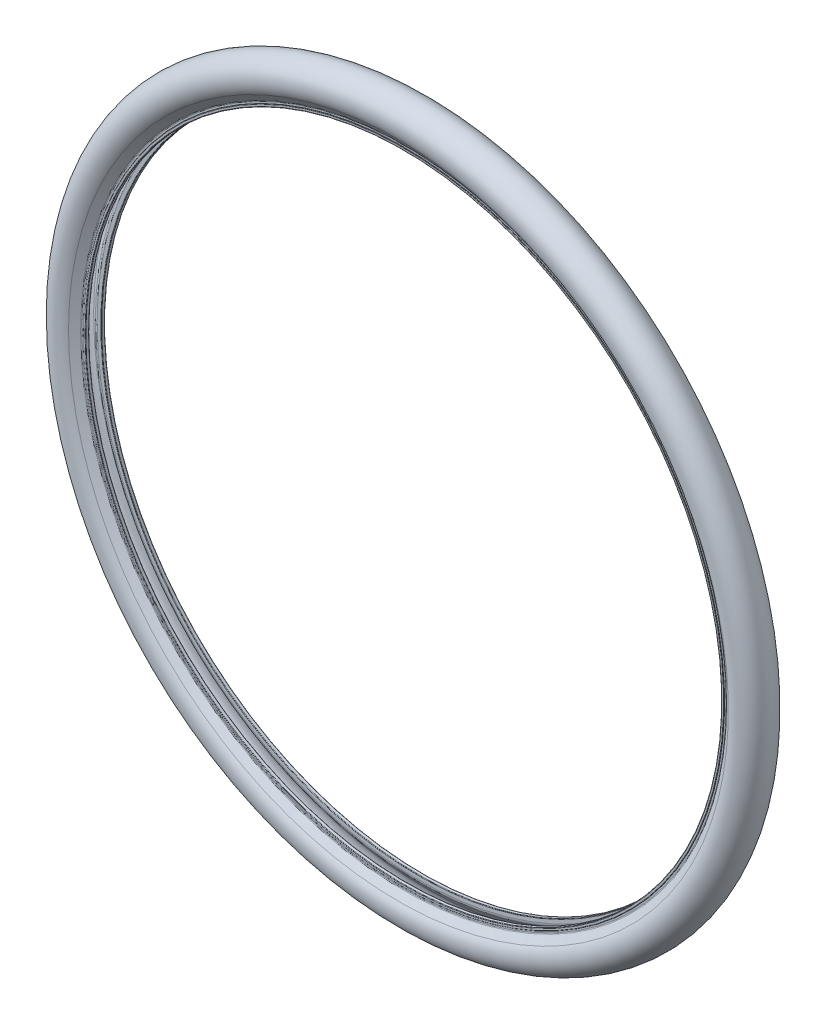
ISO-10303-21;
HEADER;
FILE_DESCRIPTION(('STEP AP214'),'2;1');
FILE_NAME('part.step','',(''),(''),'','','');
FILE_SCHEMA(('AUTOMOTIVE_DESIGN { 1 0 10303 214 1 1 1 1 }'));
ENDSEC;
DATA;
#1=APPLICATION_CONTEXT('core data for automotive mechanical design processes');
#2=APPLICATION_PROTOCOL_DEFINITION('international standard','automotive_design',2000,#1);
#3=PRODUCT_CONTEXT('',#1,'mechanical');
#4=PRODUCT('Part','Part','',(#3));
#5=PRODUCT_RELATED_PRODUCT_CATEGORY('part','',(#4));
#6=PRODUCT_DEFINITION_FORMATION('','',#4);
#7=PRODUCT_DEFINITION_CONTEXT('part definition',#1,'design');
#8=PRODUCT_DEFINITION('design','',#6,#7);
#9=PRODUCT_DEFINITION_SHAPE('','',#8);
#10=(LENGTH_UNIT() NAMED_UNIT(*) SI_UNIT(.MILLI.,.METRE.));
#11=(NAMED_UNIT(*) PLANE_ANGLE_UNIT() SI_UNIT($,.RADIAN.));
#12=(NAMED_UNIT(*) SI_UNIT($,.STERADIAN.) SOLID_ANGLE_UNIT());
#13=UNCERTAINTY_MEASURE_WITH_UNIT(LENGTH_MEASURE(1.E-05),#10,'distance_accuracy_value','');
#14=(GEOMETRIC_REPRESENTATION_CONTEXT(3) GLOBAL_UNCERTAINTY_ASSIGNED_CONTEXT((#13)) GLOBAL_UNIT_ASSIGNED_CONTEXT((#10,
#11,#12)) REPRESENTATION_CONTEXT('',''));
#15=CARTESIAN_POINT('',(0.,0.,0.));
#16=DIRECTION('',(0.,0.,1.));
#17=DIRECTION('',(1.,0.,0.));
#18=AXIS2_PLACEMENT_3D('',#15,#16,#17);
#19=CARTESIAN_POINT('',(0.,0.,-66.4924890033597));
#20=DIRECTION('',(0.,0.,-1.));
#21=DIRECTION('',(-1.,0.,0.));
#22=AXIS2_PLACEMENT_3D('',#19,#20,#21);
#23=CYLINDRICAL_SURFACE('',#22,312.);
#24=CARTESIAN_POINT('',(0.,0.,6.50000000000001));
#25=DIRECTION('',(0.,0.,-1.));
#26=DIRECTION('',(-1.,0.,0.));
#27=AXIS2_PLACEMENT_3D('',#24,#25,#26);
#28=CIRCLE('',#27,312.);
#29=CARTESIAN_POINT('',(-312.,0.,6.50000000000001));
#30=VERTEX_POINT('',#29);
#31=EDGE_CURVE('E10',#30,#30,#28,.T.);
#32=ORIENTED_EDGE('',*,*,#31,.T.);
#33=EDGE_LOOP('',(#32));
#34=FACE_BOUND('',#33,.T.);
#35=CARTESIAN_POINT('',(0.,0.,9.00000000000001));
#36=DIRECTION('',(0.,0.,-1.));
#37=DIRECTION('',(-1.,0.,0.));
#38=AXIS2_PLACEMENT_3D('',#35,#36,#37);
#39=CIRCLE('',#38,312.);
#40=CARTESIAN_POINT('',(-312.,0.,9.00000000000001));
#41=VERTEX_POINT('',#40);
#42=EDGE_CURVE('E65',#41,#41,#39,.F.);
#43=ORIENTED_EDGE('',*,*,#42,.T.);
#44=EDGE_LOOP('',(#43));
#45=FACE_BOUND('',#44,.T.);
#46=ADVANCED_FACE('F24',(#34,#45),#23,.F.);
#47=CARTESIAN_POINT('',(0.,0.,10.5));
#48=DIRECTION('',(0.,0.,-1.));
#49=DIRECTION('',(-1.,0.,0.));
#50=AXIS2_PLACEMENT_3D('',#47,#48,#49);
#51=TOROIDAL_SURFACE('',#50,316.,1.49999999999997);
#52=CARTESIAN_POINT('',(0.,0.,9.30000000000003));
#53=DIRECTION('',(0.,0.,-1.));
#54=DIRECTION('',(-1.,0.,0.));
#55=AXIS2_PLACEMENT_3D('',#52,#53,#54);
#56=CIRCLE('',#55,316.9);
#57=CARTESIAN_POINT('',(-316.9,0.,9.30000000000003));
#58=VERTEX_POINT('',#57);
#59=EDGE_CURVE('E68',#58,#58,#56,.T.);
#60=ORIENTED_EDGE('',*,*,#59,.F.);
#61=EDGE_LOOP('',(#60));
#62=FACE_BOUND('',#61,.T.);
#63=CARTESIAN_POINT('',(0.,0.,8.99999999999999));
#64=DIRECTION('',(0.,0.,-1.));
#65=DIRECTION('',(-1.,0.,0.));
#66=AXIS2_PLACEMENT_3D('',#63,#64,#65);
#67=CIRCLE('',#66,316.);
#68=CARTESIAN_POINT('',(-316.,0.,8.99999999999999));
#69=VERTEX_POINT('',#68);
#70=EDGE_CURVE('E89',#69,#69,#67,.T.);
#71=ORIENTED_EDGE('',*,*,#70,.T.);
#72=EDGE_LOOP('',(#71));
#73=FACE_BOUND('',#72,.T.);
#74=ADVANCED_FACE('F26',(#62,#73),#51,.F.);
#75=CARTESIAN_POINT('',(0.,0.,9.30000000000003));
#76=DIRECTION('',(0.,0.,1.));
#77=DIRECTION('',(1.,0.,0.));
#78=AXIS2_PLACEMENT_3D('',#75,#76,#77);
#79=CONICAL_SURFACE('',#78,316.9,0.92729521800161);
#80=CARTESIAN_POINT('',(0.,0.,14.4));
#81=DIRECTION('',(0.,0.,-1.));
#82=DIRECTION('',(-1.,0.,0.));
#83=AXIS2_PLACEMENT_3D('',#80,#81,#82);
#84=CIRCLE('',#83,323.7);
#85=CARTESIAN_POINT('',(-323.7,0.,14.4));
#86=VERTEX_POINT('',#85);
#87=EDGE_CURVE('E71',#86,#86,#84,.T.);
#88=ORIENTED_EDGE('',*,*,#87,.F.);
#89=EDGE_LOOP('',(#88));
#90=FACE_BOUND('',#89,.T.);
#91=ORIENTED_EDGE('',*,*,#59,.T.);
#92=EDGE_LOOP('',(#91));
#93=FACE_BOUND('',#92,.T.);
#94=ADVANCED_FACE('F136',(#90,#93),#79,.F.);
#95=CARTESIAN_POINT('',(0.,0.,0.));
#96=DIRECTION('',(0.,0.,-1.));
#97=DIRECTION('',(-1.,0.,0.));
#98=AXIS2_PLACEMENT_3D('',#95,#96,#97);
#99=TOROIDAL_SURFACE('',#98,334.5,18.);
#100=CARTESIAN_POINT('',(0.,0.,-14.4));
#101=DIRECTION('',(0.,0.,-1.));
#102=DIRECTION('',(-1.,0.,0.));
#103=AXIS2_PLACEMENT_3D('',#100,#101,#102);
#104=CIRCLE('',#103,323.7);
#105=CARTESIAN_POINT('',(-323.7,0.,-14.4));
#106=VERTEX_POINT('',#105);
#107=EDGE_CURVE('E74',#106,#106,#104,.T.);
#108=ORIENTED_EDGE('',*,*,#107,.F.);
#109=EDGE_LOOP('',(#108));
#110=FACE_BOUND('',#109,.T.);
#111=ORIENTED_EDGE('',*,*,#87,.T.);
#112=EDGE_LOOP('',(#111));
#113=FACE_BOUND('',#112,.T.);
#114=ADVANCED_FACE('F316',(#110,#113),#99,.T.);
#115=CARTESIAN_POINT('',(0.,0.,-14.4));
#116=DIRECTION('',(0.,0.,-1.));
#117=DIRECTION('',(-1.,0.,0.));
#118=AXIS2_PLACEMENT_3D('',#115,#116,#117);
#119=CONICAL_SURFACE('',#118,323.7,0.927295218001609);
#120=CARTESIAN_POINT('',(0.,0.,-9.30000000000003));
#121=DIRECTION('',(0.,0.,-1.));
#122=DIRECTION('',(-1.,0.,0.));
#123=AXIS2_PLACEMENT_3D('',#120,#121,#122);
#124=CIRCLE('',#123,316.9);
#125=CARTESIAN_POINT('',(-316.9,0.,-9.30000000000003));
#126=VERTEX_POINT('',#125);
#127=EDGE_CURVE('E77',#126,#126,#124,.T.);
#128=ORIENTED_EDGE('',*,*,#127,.F.);
#129=EDGE_LOOP('',(#128));
#130=FACE_BOUND('',#129,.T.);
#131=ORIENTED_EDGE('',*,*,#107,.T.);
#132=EDGE_LOOP('',(#131));
#133=FACE_BOUND('',#132,.T.);
#134=ADVANCED_FACE('F308',(#130,#133),#119,.F.);
#135=CARTESIAN_POINT('',(0.,0.,-10.5));
#136=DIRECTION('',(0.,0.,-1.));
#137=DIRECTION('',(-1.,0.,0.));
#138=AXIS2_PLACEMENT_3D('',#135,#136,#137);
#139=TOROIDAL_SURFACE('',#138,316.,1.49999999999997);
#140=CARTESIAN_POINT('',(0.,0.,-9.00000000000002));
#141=DIRECTION('',(0.,0.,-1.));
#142=DIRECTION('',(-1.,0.,0.));
#143=AXIS2_PLACEMENT_3D('',#140,#141,#142);
#144=CIRCLE('',#143,316.);
#145=CARTESIAN_POINT('',(-316.,0.,-9.00000000000002));
#146=VERTEX_POINT('',#145);
#147=EDGE_CURVE('E80',#146,#146,#144,.T.);
#148=ORIENTED_EDGE('',*,*,#147,.F.);
#149=EDGE_LOOP('',(#148));
#150=FACE_BOUND('',#149,.T.);
#151=ORIENTED_EDGE('',*,*,#127,.T.);
#152=EDGE_LOOP('',(#151));
#153=FACE_BOUND('',#152,.T.);
#154=ADVANCED_FACE('F300',(#150,#153),#139,.F.);
#155=CARTESIAN_POINT('',(0.,314.5,-9.00000000000001));
#156=DIRECTION('',(0.,0.,1.));
#157=DIRECTION('',(1.,0.,0.));
#158=AXIS2_PLACEMENT_3D('',#155,#156,#157);
#159=PLANE('',#158);
#160=CARTESIAN_POINT('',(0.,0.,-9.));
#161=DIRECTION('',(0.,0.,-1.));
#162=DIRECTION('',(-1.,0.,0.));
#163=AXIS2_PLACEMENT_3D('',#160,#161,#162);
#164=CIRCLE('',#163,314.5);
#165=CARTESIAN_POINT('',(-314.5,0.,-9.));
#166=VERTEX_POINT('',#165);
#167=EDGE_CURVE('E83',#166,#166,#164,.T.);
#168=ORIENTED_EDGE('',*,*,#167,.F.);
#169=EDGE_LOOP('',(#168));
#170=FACE_BOUND('',#169,.T.);
#171=ORIENTED_EDGE('',*,*,#147,.T.);
#172=EDGE_LOOP('',(#171));
#173=FACE_BOUND('',#172,.T.);
#174=ADVANCED_FACE('F293',(#170,#173),#159,.F.);
#175=CARTESIAN_POINT('',(0.,0.,-66.4924890033597));
#176=DIRECTION('',(0.,0.,-1.));
#177=DIRECTION('',(-1.,0.,0.));
#178=AXIS2_PLACEMENT_3D('',#175,#176,#177);
#179=CYLINDRICAL_SURFACE('',#178,314.5);
#180=CARTESIAN_POINT('',(0.,0.,-9.1));
#181=DIRECTION('',(0.,0.,1.));
#182=DIRECTION('',(1.,0.,0.));
#183=AXIS2_PLACEMENT_3D('',#180,#181,#182);
#184=CIRCLE('',#183,314.5);
#185=CARTESIAN_POINT('',(314.5,0.,-9.1));
#186=VERTEX_POINT('',#185);
#187=EDGE_CURVE('E50',#186,#186,#184,.T.);
#188=ORIENTED_EDGE('',*,*,#187,.T.);
#189=EDGE_LOOP('',(#188));
#190=FACE_BOUND('',#189,.T.);
#191=ORIENTED_EDGE('',*,*,#167,.T.);
#192=EDGE_LOOP('',(#191));
#193=FACE_BOUND('',#192,.T.);
#194=ADVANCED_FACE('F151',(#190,#193),#179,.T.);
#195=CARTESIAN_POINT('',(0.,314.5,-9.5));
#196=DIRECTION('',(0.,0.,1.));
#197=DIRECTION('',(1.,0.,0.));
#198=AXIS2_PLACEMENT_3D('',#195,#196,#197);
#199=PLANE('',#198);
#200=CARTESIAN_POINT('',(0.,0.,-9.5));
#201=DIRECTION('',(0.,0.,1.));
#202=DIRECTION('',(1.,0.,0.));
#203=AXIS2_PLACEMENT_3D('',#200,#201,#202);
#204=CIRCLE('',#203,314.1);
#205=CARTESIAN_POINT('',(314.1,0.,-9.5));
#206=VERTEX_POINT('',#205);
#207=EDGE_CURVE('E53',#206,#206,#204,.F.);
#208=ORIENTED_EDGE('',*,*,#207,.T.);
#209=EDGE_LOOP('',(#208));
#210=FACE_BOUND('',#209,.T.);
#211=CARTESIAN_POINT('',(0.,0.,-9.5));
#212=DIRECTION('',(0.,0.,1.));
#213=DIRECTION('',(1.,0.,0.));
#214=AXIS2_PLACEMENT_3D('',#211,#212,#213);
#215=CIRCLE('',#214,312.5);
#216=CARTESIAN_POINT('',(312.5,0.,-9.5));
#217=VERTEX_POINT('',#216);
#218=EDGE_CURVE('E59',#217,#217,#215,.T.);
#219=ORIENTED_EDGE('',*,*,#218,.T.);
#220=EDGE_LOOP('',(#219));
#221=FACE_BOUND('',#220,.T.);
#222=ADVANCED_FACE('F142',(#210,#221),#199,.F.);
#223=CARTESIAN_POINT('',(0.,0.,-6.50000000000001));
#224=DIRECTION('',(0.,0.,1.));
#225=DIRECTION('',(1.,0.,0.));
#226=AXIS2_PLACEMENT_3D('',#223,#224,#225);
#227=CIRCLE('',#226,312.);
#228=CARTESIAN_POINT('',(312.,0.,-6.50000000000001));
#229=VERTEX_POINT('',#228);
#230=EDGE_CURVE('E39',#229,#229,#227,.T.);
#231=ORIENTED_EDGE('',*,*,#230,.T.);
#232=EDGE_LOOP('',(#231));
#233=FACE_BOUND('',#232,.T.);
#234=CARTESIAN_POINT('',(0.,0.,-9.));
#235=DIRECTION('',(0.,0.,1.));
#236=DIRECTION('',(1.,0.,0.));
#237=AXIS2_PLACEMENT_3D('',#234,#235,#236);
#238=CIRCLE('',#237,312.);
#239=CARTESIAN_POINT('',(312.,0.,-9.));
#240=VERTEX_POINT('',#239);
#241=EDGE_CURVE('E62',#240,#240,#238,.F.);
#242=ORIENTED_EDGE('',*,*,#241,.T.);
#243=EDGE_LOOP('',(#242));
#244=FACE_BOUND('',#243,.T.);
#245=ADVANCED_FACE('F130',(#233,#244),#23,.F.);
#246=CARTESIAN_POINT('',(0.,314.5,9.5));
#247=DIRECTION('',(0.,0.,-1.));
#248=DIRECTION('',(-1.,0.,0.));
#249=AXIS2_PLACEMENT_3D('',#246,#247,#248);
#250=PLANE('',#249);
#251=CARTESIAN_POINT('',(0.,0.,9.5));
#252=DIRECTION('',(0.,0.,-1.));
#253=DIRECTION('',(-1.,0.,0.));
#254=AXIS2_PLACEMENT_3D('',#251,#252,#253);
#255=CIRCLE('',#254,314.1);
#256=CARTESIAN_POINT('',(-314.1,0.,9.5));
#257=VERTEX_POINT('',#256);
#258=EDGE_CURVE('E44',#257,#257,#255,.F.);
#259=ORIENTED_EDGE('',*,*,#258,.T.);
#260=EDGE_LOOP('',(#259));
#261=FACE_BOUND('',#260,.T.);
#262=CARTESIAN_POINT('',(0.,0.,9.5));
#263=DIRECTION('',(0.,0.,-1.));
#264=DIRECTION('',(-1.,0.,0.));
#265=AXIS2_PLACEMENT_3D('',#262,#263,#264);
#266=CIRCLE('',#265,312.5);
#267=CARTESIAN_POINT('',(-312.5,0.,9.5));
#268=VERTEX_POINT('',#267);
#269=EDGE_CURVE('E56',#268,#268,#266,.T.);
#270=ORIENTED_EDGE('',*,*,#269,.T.);
#271=EDGE_LOOP('',(#270));
#272=FACE_BOUND('',#271,.T.);
#273=ADVANCED_FACE('F141',(#261,#272),#250,.F.);
#274=CARTESIAN_POINT('',(0.,0.,-66.4924890033597));
#275=DIRECTION('',(0.,0.,-1.));
#276=DIRECTION('',(-1.,0.,0.));
#277=AXIS2_PLACEMENT_3D('',#274,#275,#276);
#278=CYLINDRICAL_SURFACE('',#277,314.5);
#279=CARTESIAN_POINT('',(0.,0.,9.1));
#280=DIRECTION('',(0.,0.,-1.));
#281=DIRECTION('',(-1.,0.,0.));
#282=AXIS2_PLACEMENT_3D('',#279,#280,#281);
#283=CIRCLE('',#282,314.5);
#284=CARTESIAN_POINT('',(-314.5,0.,9.1));
#285=VERTEX_POINT('',#284);
#286=EDGE_CURVE('E47',#285,#285,#283,.T.);
#287=ORIENTED_EDGE('',*,*,#286,.T.);
#288=EDGE_LOOP('',(#287));
#289=FACE_BOUND('',#288,.T.);
#290=CARTESIAN_POINT('',(0.,0.,8.99999999999999));
#291=DIRECTION('',(0.,0.,-1.));
#292=DIRECTION('',(-1.,0.,0.));
#293=AXIS2_PLACEMENT_3D('',#290,#291,#292);
#294=CIRCLE('',#293,314.5);
#295=CARTESIAN_POINT('',(-314.5,0.,8.99999999999999));
#296=VERTEX_POINT('',#295);
#297=EDGE_CURVE('E86',#296,#296,#294,.T.);
#298=ORIENTED_EDGE('',*,*,#297,.F.);
#299=EDGE_LOOP('',(#298));
#300=FACE_BOUND('',#299,.T.);
#301=ADVANCED_FACE('F148',(#289,#300),#278,.T.);
#302=CARTESIAN_POINT('',(0.,314.5,9.));
#303=DIRECTION('',(0.,0.,-1.));
#304=DIRECTION('',(-1.,0.,0.));
#305=AXIS2_PLACEMENT_3D('',#302,#303,#304);
#306=PLANE('',#305);
#307=ORIENTED_EDGE('',*,*,#70,.F.);
#308=EDGE_LOOP('',(#307));
#309=FACE_BOUND('',#308,.T.);
#310=ORIENTED_EDGE('',*,*,#297,.T.);
#311=EDGE_LOOP('',(#310));
#312=FACE_BOUND('',#311,.T.);
#313=ADVANCED_FACE('F160',(#309,#312),#306,.F.);
#314=CARTESIAN_POINT('',(0.,0.,-9.));
#315=DIRECTION('',(0.,0.,1.));
#316=DIRECTION('',(1.,0.,0.));
#317=AXIS2_PLACEMENT_3D('',#314,#315,#316);
#318=TOROIDAL_SURFACE('',#317,312.5,0.5);
#319=ORIENTED_EDGE('',*,*,#218,.F.);
#320=EDGE_LOOP('',(#319));
#321=FACE_BOUND('',#320,.T.);
#322=ORIENTED_EDGE('',*,*,#241,.F.);
#323=EDGE_LOOP('',(#322));
#324=FACE_BOUND('',#323,.T.);
#325=ADVANCED_FACE('F157',(#321,#324),#318,.T.);
#326=CARTESIAN_POINT('',(0.,0.,9.00000000000001));
#327=DIRECTION('',(0.,0.,-1.));
#328=DIRECTION('',(-1.,0.,0.));
#329=AXIS2_PLACEMENT_3D('',#326,#327,#328);
#330=TOROIDAL_SURFACE('',#329,312.5,0.5);
#331=ORIENTED_EDGE('',*,*,#42,.F.);
#332=EDGE_LOOP('',(#331));
#333=FACE_BOUND('',#332,.T.);
#334=ORIENTED_EDGE('',*,*,#269,.F.);
#335=EDGE_LOOP('',(#334));
#336=FACE_BOUND('',#335,.T.);
#337=ADVANCED_FACE('F159',(#333,#336),#330,.T.);
#338=CARTESIAN_POINT('',(0.,0.,-9.1));
#339=DIRECTION('',(0.,0.,1.));
#340=DIRECTION('',(1.,0.,0.));
#341=AXIS2_PLACEMENT_3D('',#338,#339,#340);
#342=TOROIDAL_SURFACE('',#341,314.1,0.4);
#343=ORIENTED_EDGE('',*,*,#187,.F.);
#344=EDGE_LOOP('',(#343));
#345=FACE_BOUND('',#344,.T.);
#346=ORIENTED_EDGE('',*,*,#207,.F.);
#347=EDGE_LOOP('',(#346));
#348=FACE_BOUND('',#347,.T.);
#349=ADVANCED_FACE('F167',(#345,#348),#342,.T.);
#350=CARTESIAN_POINT('',(0.,0.,9.1));
#351=DIRECTION('',(0.,0.,-1.));
#352=DIRECTION('',(-1.,0.,0.));
#353=AXIS2_PLACEMENT_3D('',#350,#351,#352);
#354=TOROIDAL_SURFACE('',#353,314.1,0.4);
#355=ORIENTED_EDGE('',*,*,#258,.F.);
#356=EDGE_LOOP('',(#355));
#357=FACE_BOUND('',#356,.T.);
#358=ORIENTED_EDGE('',*,*,#286,.F.);
#359=EDGE_LOOP('',(#358));
#360=FACE_BOUND('',#359,.T.);
#361=ADVANCED_FACE('F185',(#357,#360),#354,.T.);
#362=CARTESIAN_POINT('',(0.,314.5,-6.00000000000001));
#363=DIRECTION('',(0.,0.,1.));
#364=DIRECTION('',(1.,0.,0.));
#365=AXIS2_PLACEMENT_3D('',#362,#363,#364);
#366=PLANE('',#365);
#367=CARTESIAN_POINT('',(0.,0.,-6.00000000000001));
#368=DIRECTION('',(0.,0.,1.));
#369=DIRECTION('',(1.,0.,0.));
#370=AXIS2_PLACEMENT_3D('',#367,#368,#369);
#371=CIRCLE('',#370,312.5);
#372=CARTESIAN_POINT('',(312.5,0.,-6.00000000000001));
#373=VERTEX_POINT('',#372);
#374=EDGE_CURVE('E35',#373,#373,#371,.F.);
#375=ORIENTED_EDGE('',*,*,#374,.T.);
#376=EDGE_LOOP('',(#375));
#377=FACE_BOUND('',#376,.T.);
#378=CARTESIAN_POINT('',(0.,0.,-6.00000000000002));
#379=DIRECTION('',(0.,0.,-1.));
#380=DIRECTION('',(-1.,0.,0.));
#381=AXIS2_PLACEMENT_3D('',#378,#379,#380);
#382=CIRCLE('',#381,316.);
#383=CARTESIAN_POINT('',(-316.,0.,-6.00000000000002));
#384=VERTEX_POINT('',#383);
#385=EDGE_CURVE('E93',#384,#384,#382,.T.);
#386=ORIENTED_EDGE('',*,*,#385,.F.);
#387=EDGE_LOOP('',(#386));
#388=FACE_BOUND('',#387,.T.);
#389=ADVANCED_FACE('F126',(#377,#388),#366,.T.);
#390=CARTESIAN_POINT('',(0.,0.,10.5));
#391=DIRECTION('',(0.,0.,-1.));
#392=DIRECTION('',(-1.,0.,0.));
#393=AXIS2_PLACEMENT_3D('',#390,#391,#392);
#394=TOROIDAL_SURFACE('',#393,316.,4.49999999999997);
#395=CARTESIAN_POINT('',(0.,0.,6.90000000000003));
#396=DIRECTION('',(0.,0.,1.));
#397=DIRECTION('',(1.,0.,0.));
#398=AXIS2_PLACEMENT_3D('',#395,#396,#397);
#399=CIRCLE('',#398,318.7);
#400=CARTESIAN_POINT('',(318.7,0.,6.90000000000003));
#401=VERTEX_POINT('',#400);
#402=EDGE_CURVE('E92',#401,#401,#399,.F.);
#403=ORIENTED_EDGE('',*,*,#402,.T.);
#404=EDGE_LOOP('',(#403));
#405=FACE_BOUND('',#404,.T.);
#406=CARTESIAN_POINT('',(0.,0.,6.00000000000002));
#407=DIRECTION('',(0.,0.,-1.));
#408=DIRECTION('',(-1.,0.,0.));
#409=AXIS2_PLACEMENT_3D('',#406,#407,#408);
#410=CIRCLE('',#409,316.);
#411=CARTESIAN_POINT('',(-316.,0.,6.00000000000002));
#412=VERTEX_POINT('',#411);
#413=EDGE_CURVE('E97',#412,#412,#410,.T.);
#414=ORIENTED_EDGE('',*,*,#413,.F.);
#415=EDGE_LOOP('',(#414));
#416=FACE_BOUND('',#415,.T.);
#417=ADVANCED_FACE('F111',(#405,#416),#394,.T.);
#418=CARTESIAN_POINT('',(0.,0.,6.90000000000003));
#419=DIRECTION('',(0.,0.,1.));
#420=DIRECTION('',(1.,0.,0.));
#421=AXIS2_PLACEMENT_3D('',#418,#419,#420);
#422=CONICAL_SURFACE('',#421,318.7,0.92729521800161);
#423=CARTESIAN_POINT('',(0.,0.,12.));
#424=DIRECTION('',(0.,0.,-1.));
#425=DIRECTION('',(-1.,0.,0.));
#426=AXIS2_PLACEMENT_3D('',#423,#424,#425);
#427=CIRCLE('',#426,325.5);
#428=CARTESIAN_POINT('',(-325.5,0.,12.));
#429=VERTEX_POINT('',#428);
#430=EDGE_CURVE('E103',#429,#429,#427,.T.);
#431=ORIENTED_EDGE('',*,*,#430,.T.);
#432=EDGE_LOOP('',(#431));
#433=FACE_BOUND('',#432,.T.);
#434=ORIENTED_EDGE('',*,*,#402,.F.);
#435=EDGE_LOOP('',(#434));
#436=FACE_BOUND('',#435,.T.);
#437=ADVANCED_FACE('F114',(#433,#436),#422,.T.);
#438=CARTESIAN_POINT('',(0.,0.,0.));
#439=DIRECTION('',(0.,0.,-1.));
#440=DIRECTION('',(-1.,0.,0.));
#441=AXIS2_PLACEMENT_3D('',#438,#439,#440);
#442=TOROIDAL_SURFACE('',#441,334.5,15.0000000000001);
#443=CARTESIAN_POINT('',(0.,0.,-12.));
#444=DIRECTION('',(0.,0.,-1.));
#445=DIRECTION('',(-1.,0.,0.));
#446=AXIS2_PLACEMENT_3D('',#443,#444,#445);
#447=CIRCLE('',#446,325.5);
#448=CARTESIAN_POINT('',(-325.5,0.,-12.));
#449=VERTEX_POINT('',#448);
#450=EDGE_CURVE('E100',#449,#449,#447,.T.);
#451=ORIENTED_EDGE('',*,*,#450,.T.);
#452=EDGE_LOOP('',(#451));
#453=FACE_BOUND('',#452,.T.);
#454=ORIENTED_EDGE('',*,*,#430,.F.);
#455=EDGE_LOOP('',(#454));
#456=FACE_BOUND('',#455,.T.);
#457=ADVANCED_FACE('F116',(#453,#456),#442,.F.);
#458=CARTESIAN_POINT('',(0.,0.,-12.));
#459=DIRECTION('',(0.,0.,-1.));
#460=DIRECTION('',(-1.,0.,0.));
#461=AXIS2_PLACEMENT_3D('',#458,#459,#460);
#462=CONICAL_SURFACE('',#461,325.5,0.927295218001609);
#463=CARTESIAN_POINT('',(0.,0.,-6.89999999999999));
#464=DIRECTION('',(0.,0.,-1.));
#465=DIRECTION('',(-1.,0.,0.));
#466=AXIS2_PLACEMENT_3D('',#463,#464,#465);
#467=CIRCLE('',#466,318.7);
#468=CARTESIAN_POINT('',(-318.7,0.,-6.89999999999999));
#469=VERTEX_POINT('',#468);
#470=EDGE_CURVE('E96',#469,#469,#467,.T.);
#471=ORIENTED_EDGE('',*,*,#470,.T.);
#472=EDGE_LOOP('',(#471));
#473=FACE_BOUND('',#472,.T.);
#474=ORIENTED_EDGE('',*,*,#450,.F.);
#475=EDGE_LOOP('',(#474));
#476=FACE_BOUND('',#475,.T.);
#477=ADVANCED_FACE('F123',(#473,#476),#462,.T.);
#478=CARTESIAN_POINT('',(0.,0.,-10.5));
#479=DIRECTION('',(0.,0.,-1.));
#480=DIRECTION('',(-1.,0.,0.));
#481=AXIS2_PLACEMENT_3D('',#478,#479,#480);
#482=TOROIDAL_SURFACE('',#481,316.,4.49999999999997);
#483=ORIENTED_EDGE('',*,*,#385,.T.);
#484=EDGE_LOOP('',(#483));
#485=FACE_BOUND('',#484,.T.);
#486=ORIENTED_EDGE('',*,*,#470,.F.);
#487=EDGE_LOOP('',(#486));
#488=FACE_BOUND('',#487,.T.);
#489=ADVANCED_FACE('F199',(#485,#488),#482,.T.);
#490=CARTESIAN_POINT('',(0.,314.5,6.));
#491=DIRECTION('',(0.,0.,-1.));
#492=DIRECTION('',(-1.,0.,0.));
#493=AXIS2_PLACEMENT_3D('',#490,#491,#492);
#494=PLANE('',#493);
#495=CARTESIAN_POINT('',(0.,0.,6.));
#496=DIRECTION('',(0.,0.,-1.));
#497=DIRECTION('',(-1.,0.,0.));
#498=AXIS2_PLACEMENT_3D('',#495,#496,#497);
#499=CIRCLE('',#498,312.5);
#500=CARTESIAN_POINT('',(-312.5,0.,6.));
#501=VERTEX_POINT('',#500);
#502=EDGE_CURVE('E31',#501,#501,#499,.F.);
#503=ORIENTED_EDGE('',*,*,#502,.T.);
#504=EDGE_LOOP('',(#503));
#505=FACE_BOUND('',#504,.T.);
#506=ORIENTED_EDGE('',*,*,#413,.T.);
#507=EDGE_LOOP('',(#506));
#508=FACE_BOUND('',#507,.T.);
#509=ADVANCED_FACE('F196',(#505,#508),#494,.T.);
#510=CARTESIAN_POINT('',(0.,0.,-6.50000000000001));
#511=DIRECTION('',(0.,0.,1.));
#512=DIRECTION('',(1.,0.,0.));
#513=AXIS2_PLACEMENT_3D('',#510,#511,#512);
#514=TOROIDAL_SURFACE('',#513,312.5,0.5);
#515=ORIENTED_EDGE('',*,*,#374,.F.);
#516=EDGE_LOOP('',(#515));
#517=FACE_BOUND('',#516,.T.);
#518=ORIENTED_EDGE('',*,*,#230,.F.);
#519=EDGE_LOOP('',(#518));
#520=FACE_BOUND('',#519,.T.);
#521=ADVANCED_FACE('F198',(#517,#520),#514,.T.);
#522=CARTESIAN_POINT('',(0.,0.,6.50000000000001));
#523=DIRECTION('',(0.,0.,-1.));
#524=DIRECTION('',(-1.,0.,0.));
#525=AXIS2_PLACEMENT_3D('',#522,#523,#524);
#526=TOROIDAL_SURFACE('',#525,312.5,0.5);
#527=ORIENTED_EDGE('',*,*,#31,.F.);
#528=EDGE_LOOP('',(#527));
#529=FACE_BOUND('',#528,.T.);
#530=ORIENTED_EDGE('',*,*,#502,.F.);
#531=EDGE_LOOP('',(#530));
#532=FACE_BOUND('',#531,.T.);
#533=ADVANCED_FACE('F234',(#529,#532),#526,.T.);
#534=CLOSED_SHELL('',(#46,#74,#94,#114,#134,#154,#174,#194,#222,#245,#273,#301,#313,#325,#337,
#349,#361,#389,#417,#437,#457,#477,#489,#509,#521,#533));
#535=MANIFOLD_SOLID_BREP('B2',#534);
#536=ADVANCED_BREP_SHAPE_REPRESENTATION('',(#18,#535),#14);
#537=SHAPE_DEFINITION_REPRESENTATION(#9,#536);
ENDSEC;
END-ISO-10303-21;
